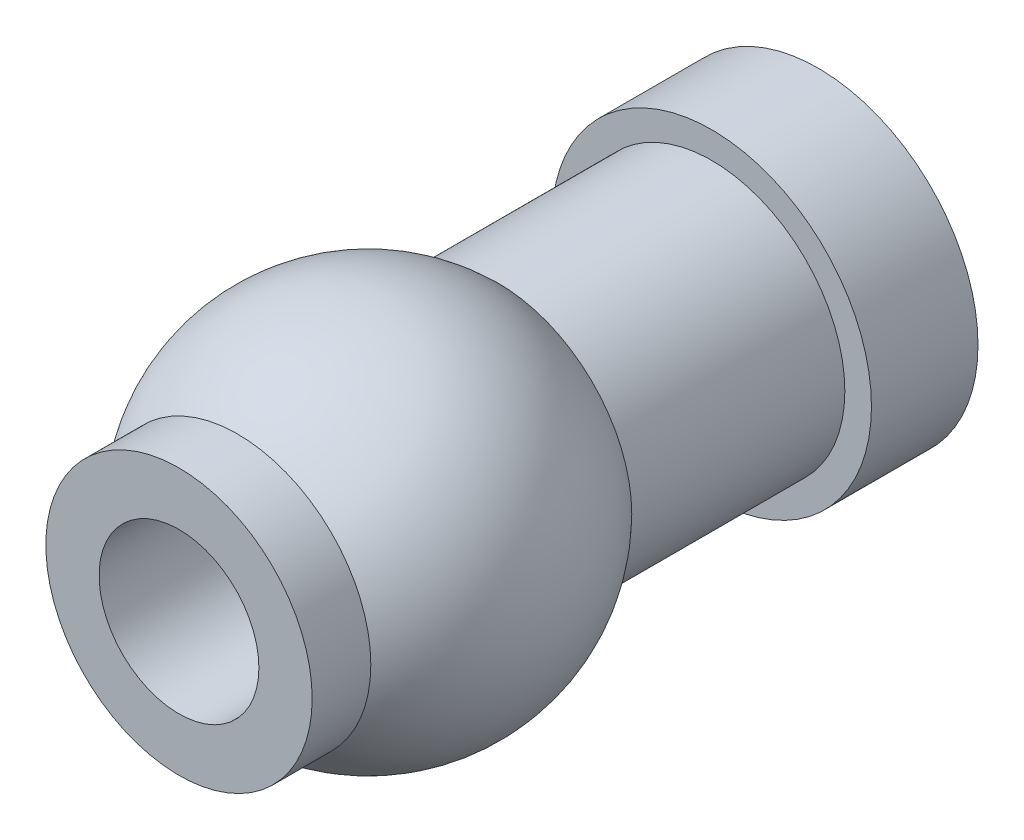
ISO-10303-21;
HEADER;
FILE_DESCRIPTION(('STEP AP214'),'2;1');
FILE_NAME('part.step','',(''),(''),'','','');
FILE_SCHEMA(('AUTOMOTIVE_DESIGN { 1 0 10303 214 1 1 1 1 }'));
ENDSEC;
DATA;
#1=APPLICATION_CONTEXT('core data for automotive mechanical design processes');
#2=APPLICATION_PROTOCOL_DEFINITION('international standard','automotive_design',2000,#1);
#3=PRODUCT_CONTEXT('',#1,'mechanical');
#4=PRODUCT('Part','Part','',(#3));
#5=PRODUCT_RELATED_PRODUCT_CATEGORY('part','',(#4));
#6=PRODUCT_DEFINITION_FORMATION('','',#4);
#7=PRODUCT_DEFINITION_CONTEXT('part definition',#1,'design');
#8=PRODUCT_DEFINITION('design','',#6,#7);
#9=PRODUCT_DEFINITION_SHAPE('','',#8);
#10=(LENGTH_UNIT() NAMED_UNIT(*) SI_UNIT(.MILLI.,.METRE.));
#11=(NAMED_UNIT(*) PLANE_ANGLE_UNIT() SI_UNIT($,.RADIAN.));
#12=(NAMED_UNIT(*) SI_UNIT($,.STERADIAN.) SOLID_ANGLE_UNIT());
#13=UNCERTAINTY_MEASURE_WITH_UNIT(LENGTH_MEASURE(1.E-05),#10,'distance_accuracy_value','');
#14=(GEOMETRIC_REPRESENTATION_CONTEXT(3) GLOBAL_UNCERTAINTY_ASSIGNED_CONTEXT((#13)) GLOBAL_UNIT_ASSIGNED_CONTEXT((#10,
#11,#12)) REPRESENTATION_CONTEXT('',''));
#15=CARTESIAN_POINT('',(0.,0.,0.));
#16=DIRECTION('',(0.,0.,1.));
#17=DIRECTION('',(1.,0.,0.));
#18=AXIS2_PLACEMENT_3D('',#15,#16,#17);
#19=CARTESIAN_POINT('',(0.,0.,0.));
#20=DIRECTION('',(0.,0.,1.));
#21=DIRECTION('',(1.,0.,0.));
#22=AXIS2_PLACEMENT_3D('',#19,#20,#21);
#23=CYLINDRICAL_SURFACE('',#22,1.5);
#24=CARTESIAN_POINT('',(0.,0.,0.));
#25=DIRECTION('',(0.,0.,1.));
#26=DIRECTION('',(1.,0.,0.));
#27=AXIS2_PLACEMENT_3D('',#24,#25,#26);
#28=CIRCLE('',#27,1.5);
#29=CARTESIAN_POINT('',(1.5,0.,0.));
#30=VERTEX_POINT('',#29);
#31=EDGE_CURVE('E61',#30,#30,#28,.T.);
#32=ORIENTED_EDGE('',*,*,#31,.T.);
#33=EDGE_LOOP('',(#32));
#34=FACE_BOUND('',#33,.T.);
#35=CARTESIAN_POINT('',(0.,0.,-12.));
#36=DIRECTION('',(0.,0.,1.));
#37=DIRECTION('',(1.,0.,0.));
#38=AXIS2_PLACEMENT_3D('',#35,#36,#37);
#39=CIRCLE('',#38,1.5);
#40=CARTESIAN_POINT('',(1.5,0.,-12.));
#41=VERTEX_POINT('',#40);
#42=EDGE_CURVE('E10',#41,#41,#39,.T.);
#43=ORIENTED_EDGE('',*,*,#42,.F.);
#44=EDGE_LOOP('',(#43));
#45=FACE_BOUND('',#44,.T.);
#46=ADVANCED_FACE('F33',(#34,#45),#23,.F.);
#47=CARTESIAN_POINT('',(0.,0.,-12.));
#48=DIRECTION('',(0.,0.,1.));
#49=DIRECTION('',(1.,0.,0.));
#50=AXIS2_PLACEMENT_3D('',#47,#48,#49);
#51=PLANE('',#50);
#52=CARTESIAN_POINT('',(0.,0.,-12.));
#53=DIRECTION('',(0.,0.,1.));
#54=DIRECTION('',(1.,0.,0.));
#55=AXIS2_PLACEMENT_3D('',#52,#53,#54);
#56=CIRCLE('',#55,3.);
#57=CARTESIAN_POINT('',(3.,0.,-12.));
#58=VERTEX_POINT('',#57);
#59=EDGE_CURVE('E39',#58,#58,#56,.T.);
#60=ORIENTED_EDGE('',*,*,#59,.F.);
#61=EDGE_LOOP('',(#60));
#62=FACE_BOUND('',#61,.T.);
#63=ORIENTED_EDGE('',*,*,#42,.T.);
#64=EDGE_LOOP('',(#63));
#65=FACE_BOUND('',#64,.T.);
#66=ADVANCED_FACE('F79',(#62,#65),#51,.F.);
#67=CARTESIAN_POINT('',(0.,0.,0.));
#68=DIRECTION('',(0.,0.,1.));
#69=DIRECTION('',(1.,0.,0.));
#70=AXIS2_PLACEMENT_3D('',#67,#68,#69);
#71=CYLINDRICAL_SURFACE('',#70,3.);
#72=CARTESIAN_POINT('',(0.,0.,-10.));
#73=DIRECTION('',(0.,0.,1.));
#74=DIRECTION('',(1.,0.,0.));
#75=AXIS2_PLACEMENT_3D('',#72,#73,#74);
#76=CIRCLE('',#75,3.);
#77=CARTESIAN_POINT('',(3.,0.,-10.));
#78=VERTEX_POINT('',#77);
#79=EDGE_CURVE('E43',#78,#78,#76,.T.);
#80=ORIENTED_EDGE('',*,*,#79,.F.);
#81=EDGE_LOOP('',(#80));
#82=FACE_BOUND('',#81,.T.);
#83=ORIENTED_EDGE('',*,*,#59,.T.);
#84=EDGE_LOOP('',(#83));
#85=FACE_BOUND('',#84,.T.);
#86=ADVANCED_FACE('F83',(#82,#85),#71,.T.);
#87=CARTESIAN_POINT('',(0.,0.,-10.));
#88=DIRECTION('',(0.,0.,-1.));
#89=DIRECTION('',(-1.,0.,0.));
#90=AXIS2_PLACEMENT_3D('',#87,#88,#89);
#91=PLANE('',#90);
#92=CARTESIAN_POINT('',(0.,0.,-10.));
#93=DIRECTION('',(0.,0.,1.));
#94=DIRECTION('',(1.,0.,0.));
#95=AXIS2_PLACEMENT_3D('',#92,#93,#94);
#96=CIRCLE('',#95,2.5);
#97=CARTESIAN_POINT('',(2.5,0.,-10.));
#98=VERTEX_POINT('',#97);
#99=EDGE_CURVE('E47',#98,#98,#96,.T.);
#100=ORIENTED_EDGE('',*,*,#99,.F.);
#101=EDGE_LOOP('',(#100));
#102=FACE_BOUND('',#101,.T.);
#103=ORIENTED_EDGE('',*,*,#79,.T.);
#104=EDGE_LOOP('',(#103));
#105=FACE_BOUND('',#104,.T.);
#106=ADVANCED_FACE('F88',(#102,#105),#91,.F.);
#107=CARTESIAN_POINT('',(0.,0.,0.));
#108=DIRECTION('',(0.,0.,1.));
#109=DIRECTION('',(1.,0.,0.));
#110=AXIS2_PLACEMENT_3D('',#107,#108,#109);
#111=CYLINDRICAL_SURFACE('',#110,2.5);
#112=CARTESIAN_POINT('',(0.,0.,-6.));
#113=DIRECTION('',(0.,0.,1.));
#114=DIRECTION('',(1.,0.,0.));
#115=AXIS2_PLACEMENT_3D('',#112,#113,#114);
#116=CIRCLE('',#115,2.5);
#117=CARTESIAN_POINT('',(2.5,0.,-6.));
#118=VERTEX_POINT('',#117);
#119=EDGE_CURVE('E52',#118,#118,#116,.T.);
#120=ORIENTED_EDGE('',*,*,#119,.F.);
#121=EDGE_LOOP('',(#120));
#122=FACE_BOUND('',#121,.T.);
#123=ORIENTED_EDGE('',*,*,#99,.T.);
#124=EDGE_LOOP('',(#123));
#125=FACE_BOUND('',#124,.T.);
#126=ADVANCED_FACE('F94',(#122,#125),#111,.T.);
#127=CARTESIAN_POINT('',(0.,0.,-3.55051025721682));
#128=DIRECTION('',(0.,0.,1.));
#129=DIRECTION('',(0.,1.,0.));
#130=AXIS2_PLACEMENT_3D('',#127,#128,#129);
#131=SPHERICAL_SURFACE('',#130,3.5);
#132=CARTESIAN_POINT('',(0.,0.,-1.10102051443364));
#133=DIRECTION('',(0.,0.,1.));
#134=DIRECTION('',(1.,0.,0.));
#135=AXIS2_PLACEMENT_3D('',#132,#133,#134);
#136=CIRCLE('',#135,2.5);
#137=CARTESIAN_POINT('',(2.5,0.,-1.10102051443364));
#138=VERTEX_POINT('',#137);
#139=EDGE_CURVE('E55',#138,#138,#136,.T.);
#140=ORIENTED_EDGE('',*,*,#139,.F.);
#141=EDGE_LOOP('',(#140));
#142=FACE_BOUND('',#141,.T.);
#143=ORIENTED_EDGE('',*,*,#119,.T.);
#144=EDGE_LOOP('',(#143));
#145=FACE_BOUND('',#144,.T.);
#146=ADVANCED_FACE('F75',(#142,#145),#131,.T.);
#147=CARTESIAN_POINT('',(0.,0.,0.));
#148=DIRECTION('',(0.,0.,1.));
#149=DIRECTION('',(1.,0.,0.));
#150=AXIS2_PLACEMENT_3D('',#147,#148,#149);
#151=CYLINDRICAL_SURFACE('',#150,2.5);
#152=ORIENTED_EDGE('',*,*,#139,.T.);
#153=EDGE_LOOP('',(#152));
#154=FACE_BOUND('',#153,.T.);
#155=CARTESIAN_POINT('',(0.,0.,0.));
#156=DIRECTION('',(0.,0.,1.));
#157=DIRECTION('',(1.,0.,0.));
#158=AXIS2_PLACEMENT_3D('',#155,#156,#157);
#159=CIRCLE('',#158,2.5);
#160=CARTESIAN_POINT('',(2.5,0.,0.));
#161=VERTEX_POINT('',#160);
#162=EDGE_CURVE('E58',#161,#161,#159,.T.);
#163=ORIENTED_EDGE('',*,*,#162,.F.);
#164=EDGE_LOOP('',(#163));
#165=FACE_BOUND('',#164,.T.);
#166=ADVANCED_FACE('F69',(#154,#165),#151,.T.);
#167=CARTESIAN_POINT('',(0.,0.,0.));
#168=DIRECTION('',(0.,0.,1.));
#169=DIRECTION('',(1.,0.,0.));
#170=AXIS2_PLACEMENT_3D('',#167,#168,#169);
#171=PLANE('',#170);
#172=ORIENTED_EDGE('',*,*,#162,.T.);
#173=EDGE_LOOP('',(#172));
#174=FACE_BOUND('',#173,.T.);
#175=ORIENTED_EDGE('',*,*,#31,.F.);
#176=EDGE_LOOP('',(#175));
#177=FACE_BOUND('',#176,.T.);
#178=ADVANCED_FACE('F67',(#174,#177),#171,.T.);
#179=CLOSED_SHELL('',(#46,#66,#86,#106,#126,#146,#166,#178));
#180=MANIFOLD_SOLID_BREP('B2',#179);
#181=ADVANCED_BREP_SHAPE_REPRESENTATION('',(#18,#180),#14);
#182=SHAPE_DEFINITION_REPRESENTATION(#9,#181);
ENDSEC;
END-ISO-10303-21;
